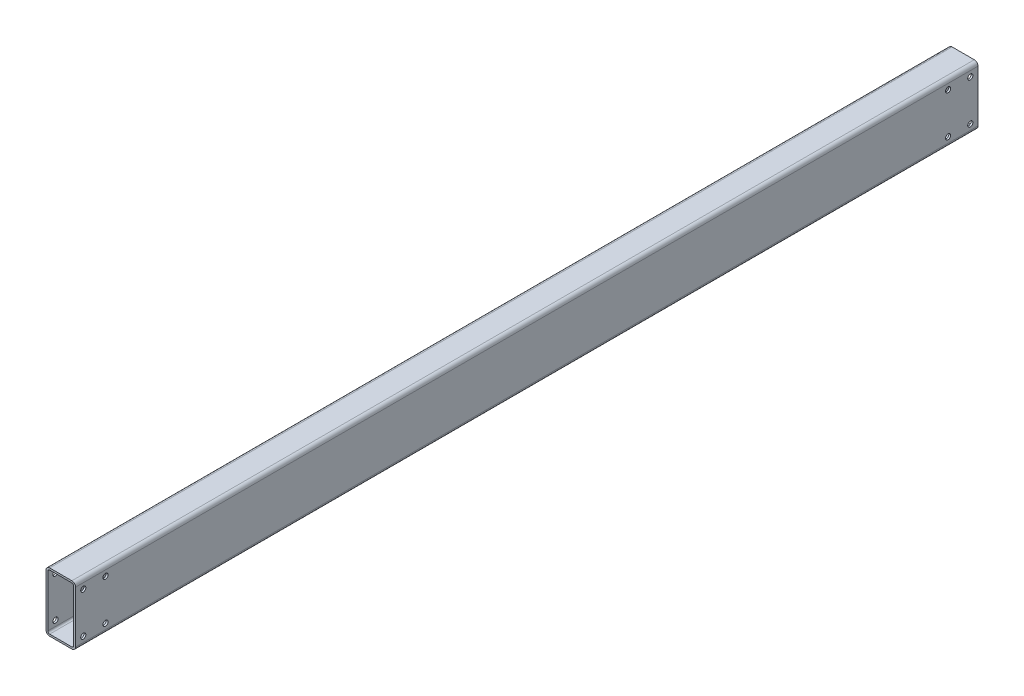
ISO-10303-21;
HEADER;
FILE_DESCRIPTION(('STEP AP214'),'2;1');
FILE_NAME('part.step','',(''),(''),'','','');
FILE_SCHEMA(('AUTOMOTIVE_DESIGN { 1 0 10303 214 1 1 1 1 }'));
ENDSEC;
DATA;
#1=APPLICATION_CONTEXT('core data for automotive mechanical design processes');
#2=APPLICATION_PROTOCOL_DEFINITION('international standard','automotive_design',2000,#1);
#3=PRODUCT_CONTEXT('',#1,'mechanical');
#4=PRODUCT('Part','Part','',(#3));
#5=PRODUCT_RELATED_PRODUCT_CATEGORY('part','',(#4));
#6=PRODUCT_DEFINITION_FORMATION('','',#4);
#7=PRODUCT_DEFINITION_CONTEXT('part definition',#1,'design');
#8=PRODUCT_DEFINITION('design','',#6,#7);
#9=PRODUCT_DEFINITION_SHAPE('','',#8);
#10=(LENGTH_UNIT() NAMED_UNIT(*) SI_UNIT(.MILLI.,.METRE.));
#11=(NAMED_UNIT(*) PLANE_ANGLE_UNIT() SI_UNIT($,.RADIAN.));
#12=(NAMED_UNIT(*) SI_UNIT($,.STERADIAN.) SOLID_ANGLE_UNIT());
#13=UNCERTAINTY_MEASURE_WITH_UNIT(LENGTH_MEASURE(1.E-05),#10,'distance_accuracy_value','');
#14=(GEOMETRIC_REPRESENTATION_CONTEXT(3) GLOBAL_UNCERTAINTY_ASSIGNED_CONTEXT((#13)) GLOBAL_UNIT_ASSIGNED_CONTEXT((#10,
#11,#12)) REPRESENTATION_CONTEXT('',''));
#15=CARTESIAN_POINT('',(0.,0.,0.));
#16=DIRECTION('',(0.,0.,1.));
#17=DIRECTION('',(1.,0.,0.));
#18=AXIS2_PLACEMENT_3D('',#15,#16,#17);
#19=CARTESIAN_POINT('',(15.,-35.,1220.));
#20=DIRECTION('',(0.,0.,1.));
#21=DIRECTION('',(1.,0.,0.));
#22=AXIS2_PLACEMENT_3D('',#19,#20,#21);
#23=PLANE('',#22);
#24=CARTESIAN_POINT('',(15.,-35.,1220.));
#25=DIRECTION('',(0.,0.,1.));
#26=DIRECTION('',(1.,0.,0.));
#27=AXIS2_PLACEMENT_3D('',#24,#25,#26);
#28=CIRCLE('',#27,5.);
#29=CARTESIAN_POINT('',(15.,-40.,1220.));
#30=VERTEX_POINT('',#29);
#31=CARTESIAN_POINT('',(20.,-35.,1220.));
#32=VERTEX_POINT('',#31);
#33=EDGE_CURVE('E221',#30,#32,#28,.T.);
#34=ORIENTED_EDGE('',*,*,#33,.T.);
#35=DIRECTION('',(0.,1.,0.));
#36=VECTOR('',#35,1.);
#37=CARTESIAN_POINT('',(20.,-35.,1220.));
#38=LINE('',#37,#36);
#39=CARTESIAN_POINT('',(20.,35.,1220.));
#40=VERTEX_POINT('',#39);
#41=EDGE_CURVE('E224',#32,#40,#38,.T.);
#42=ORIENTED_EDGE('',*,*,#41,.T.);
#43=CARTESIAN_POINT('',(15.,35.,1220.));
#44=DIRECTION('',(0.,0.,1.));
#45=DIRECTION('',(-1.,0.,0.));
#46=AXIS2_PLACEMENT_3D('',#43,#44,#45);
#47=CIRCLE('',#46,5.);
#48=CARTESIAN_POINT('',(15.,40.,1220.));
#49=VERTEX_POINT('',#48);
#50=EDGE_CURVE('E227',#40,#49,#47,.T.);
#51=ORIENTED_EDGE('',*,*,#50,.T.);
#52=DIRECTION('',(-1.,0.,0.));
#53=VECTOR('',#52,1.);
#54=CARTESIAN_POINT('',(-15.,40.,1220.));
#55=LINE('',#54,#53);
#56=CARTESIAN_POINT('',(-15.,40.,1220.));
#57=VERTEX_POINT('',#56);
#58=EDGE_CURVE('E229',#49,#57,#55,.T.);
#59=ORIENTED_EDGE('',*,*,#58,.T.);
#60=CARTESIAN_POINT('',(-15.,35.,1220.));
#61=DIRECTION('',(0.,0.,1.));
#62=DIRECTION('',(-1.,0.,0.));
#63=AXIS2_PLACEMENT_3D('',#60,#61,#62);
#64=CIRCLE('',#63,5.);
#65=CARTESIAN_POINT('',(-20.,35.,1220.));
#66=VERTEX_POINT('',#65);
#67=EDGE_CURVE('E231',#57,#66,#64,.T.);
#68=ORIENTED_EDGE('',*,*,#67,.T.);
#69=DIRECTION('',(0.,-1.,0.));
#70=VECTOR('',#69,1.);
#71=CARTESIAN_POINT('',(-20.,-35.,1220.));
#72=LINE('',#71,#70);
#73=CARTESIAN_POINT('',(-20.,-35.,1220.));
#74=VERTEX_POINT('',#73);
#75=EDGE_CURVE('E233',#66,#74,#72,.T.);
#76=ORIENTED_EDGE('',*,*,#75,.T.);
#77=CARTESIAN_POINT('',(-15.,-35.,1220.));
#78=DIRECTION('',(0.,0.,1.));
#79=DIRECTION('',(-1.,0.,0.));
#80=AXIS2_PLACEMENT_3D('',#77,#78,#79);
#81=CIRCLE('',#80,5.);
#82=CARTESIAN_POINT('',(-15.,-40.,1220.));
#83=VERTEX_POINT('',#82);
#84=EDGE_CURVE('E235',#74,#83,#81,.T.);
#85=ORIENTED_EDGE('',*,*,#84,.T.);
#86=DIRECTION('',(1.,0.,0.));
#87=VECTOR('',#86,1.);
#88=CARTESIAN_POINT('',(-15.,-40.,1220.));
#89=LINE('',#88,#87);
#90=EDGE_CURVE('E237',#83,#30,#89,.T.);
#91=ORIENTED_EDGE('',*,*,#90,.T.);
#92=EDGE_LOOP('',(#34,#42,#51,#59,#68,#76,#85,#91));
#93=FACE_BOUND('',#92,.T.);
#94=DIRECTION('',(1.,0.,0.));
#95=VECTOR('',#94,1.);
#96=CARTESIAN_POINT('',(-15.,-37.5,1220.));
#97=LINE('',#96,#95);
#98=CARTESIAN_POINT('',(-15.,-37.5,1220.));
#99=VERTEX_POINT('',#98);
#100=CARTESIAN_POINT('',(15.,-37.5,1220.));
#101=VERTEX_POINT('',#100);
#102=EDGE_CURVE('E162',#99,#101,#97,.T.);
#103=ORIENTED_EDGE('',*,*,#102,.F.);
#104=CARTESIAN_POINT('',(-15.,-35.,1220.));
#105=DIRECTION('',(0.,0.,1.));
#106=DIRECTION('',(-1.,0.,0.));
#107=AXIS2_PLACEMENT_3D('',#104,#105,#106);
#108=CIRCLE('',#107,2.5);
#109=CARTESIAN_POINT('',(-17.5,-35.,1220.));
#110=VERTEX_POINT('',#109);
#111=EDGE_CURVE('E154',#110,#99,#108,.T.);
#112=ORIENTED_EDGE('',*,*,#111,.F.);
#113=DIRECTION('',(0.,-1.,0.));
#114=VECTOR('',#113,1.);
#115=CARTESIAN_POINT('',(-17.5,-35.,1220.));
#116=LINE('',#115,#114);
#117=CARTESIAN_POINT('',(-17.5,35.,1220.));
#118=VERTEX_POINT('',#117);
#119=EDGE_CURVE('E188',#118,#110,#116,.T.);
#120=ORIENTED_EDGE('',*,*,#119,.F.);
#121=CARTESIAN_POINT('',(-15.,35.,1220.));
#122=DIRECTION('',(0.,0.,1.));
#123=DIRECTION('',(-1.,0.,0.));
#124=AXIS2_PLACEMENT_3D('',#121,#122,#123);
#125=CIRCLE('',#124,2.5);
#126=CARTESIAN_POINT('',(-15.,37.5,1220.));
#127=VERTEX_POINT('',#126);
#128=EDGE_CURVE('E186',#127,#118,#125,.T.);
#129=ORIENTED_EDGE('',*,*,#128,.F.);
#130=DIRECTION('',(-1.,0.,0.));
#131=VECTOR('',#130,1.);
#132=CARTESIAN_POINT('',(-15.,37.5,1220.));
#133=LINE('',#132,#131);
#134=CARTESIAN_POINT('',(15.,37.5,1220.));
#135=VERTEX_POINT('',#134);
#136=EDGE_CURVE('E184',#135,#127,#133,.T.);
#137=ORIENTED_EDGE('',*,*,#136,.F.);
#138=CARTESIAN_POINT('',(15.,35.,1220.));
#139=DIRECTION('',(0.,0.,1.));
#140=DIRECTION('',(-1.,0.,0.));
#141=AXIS2_PLACEMENT_3D('',#138,#139,#140);
#142=CIRCLE('',#141,2.5);
#143=CARTESIAN_POINT('',(17.5,35.,1220.));
#144=VERTEX_POINT('',#143);
#145=EDGE_CURVE('E182',#144,#135,#142,.T.);
#146=ORIENTED_EDGE('',*,*,#145,.F.);
#147=DIRECTION('',(0.,1.,0.));
#148=VECTOR('',#147,1.);
#149=CARTESIAN_POINT('',(17.5,-35.,1220.));
#150=LINE('',#149,#148);
#151=CARTESIAN_POINT('',(17.5,-35.,1220.));
#152=VERTEX_POINT('',#151);
#153=EDGE_CURVE('E177',#152,#144,#150,.T.);
#154=ORIENTED_EDGE('',*,*,#153,.F.);
#155=CARTESIAN_POINT('',(15.,-35.,1220.));
#156=DIRECTION('',(0.,0.,1.));
#157=DIRECTION('',(1.,0.,0.));
#158=AXIS2_PLACEMENT_3D('',#155,#156,#157);
#159=CIRCLE('',#158,2.5);
#160=EDGE_CURVE('E175',#101,#152,#159,.T.);
#161=ORIENTED_EDGE('',*,*,#160,.F.);
#162=EDGE_LOOP('',(#103,#112,#120,#129,#137,#146,#154,#161));
#163=FACE_BOUND('',#162,.T.);
#164=ADVANCED_FACE('F39',(#93,#163),#23,.T.);
#165=CARTESIAN_POINT('',(15.,-35.,0.));
#166=DIRECTION('',(0.,0.,1.));
#167=DIRECTION('',(1.,0.,0.));
#168=AXIS2_PLACEMENT_3D('',#165,#166,#167);
#169=PLANE('',#168);
#170=CARTESIAN_POINT('',(15.,-35.,0.));
#171=DIRECTION('',(0.,0.,1.));
#172=DIRECTION('',(1.,0.,0.));
#173=AXIS2_PLACEMENT_3D('',#170,#171,#172);
#174=CIRCLE('',#173,5.);
#175=CARTESIAN_POINT('',(15.,-40.,0.));
#176=VERTEX_POINT('',#175);
#177=CARTESIAN_POINT('',(20.,-35.,0.));
#178=VERTEX_POINT('',#177);
#179=EDGE_CURVE('E170',#176,#178,#174,.T.);
#180=ORIENTED_EDGE('',*,*,#179,.F.);
#181=DIRECTION('',(1.,0.,0.));
#182=VECTOR('',#181,1.);
#183=CARTESIAN_POINT('',(-15.,-40.,0.));
#184=LINE('',#183,#182);
#185=CARTESIAN_POINT('',(-15.,-40.,0.));
#186=VERTEX_POINT('',#185);
#187=EDGE_CURVE('E225',#186,#176,#184,.T.);
#188=ORIENTED_EDGE('',*,*,#187,.F.);
#189=CARTESIAN_POINT('',(-15.,-35.,0.));
#190=DIRECTION('',(0.,0.,1.));
#191=DIRECTION('',(-1.,0.,0.));
#192=AXIS2_PLACEMENT_3D('',#189,#190,#191);
#193=CIRCLE('',#192,5.);
#194=CARTESIAN_POINT('',(-20.,-35.,0.));
#195=VERTEX_POINT('',#194);
#196=EDGE_CURVE('E252',#195,#186,#193,.T.);
#197=ORIENTED_EDGE('',*,*,#196,.F.);
#198=DIRECTION('',(0.,-1.,0.));
#199=VECTOR('',#198,1.);
#200=CARTESIAN_POINT('',(-20.,-35.,0.));
#201=LINE('',#200,#199);
#202=CARTESIAN_POINT('',(-20.,35.,0.));
#203=VERTEX_POINT('',#202);
#204=EDGE_CURVE('E250',#203,#195,#201,.T.);
#205=ORIENTED_EDGE('',*,*,#204,.F.);
#206=CARTESIAN_POINT('',(-15.,35.,0.));
#207=DIRECTION('',(0.,0.,1.));
#208=DIRECTION('',(-1.,0.,0.));
#209=AXIS2_PLACEMENT_3D('',#206,#207,#208);
#210=CIRCLE('',#209,5.);
#211=CARTESIAN_POINT('',(-15.,40.,0.));
#212=VERTEX_POINT('',#211);
#213=EDGE_CURVE('E248',#212,#203,#210,.T.);
#214=ORIENTED_EDGE('',*,*,#213,.F.);
#215=DIRECTION('',(-1.,0.,0.));
#216=VECTOR('',#215,1.);
#217=CARTESIAN_POINT('',(-15.,40.,0.));
#218=LINE('',#217,#216);
#219=CARTESIAN_POINT('',(15.,40.,0.));
#220=VERTEX_POINT('',#219);
#221=EDGE_CURVE('E246',#220,#212,#218,.T.);
#222=ORIENTED_EDGE('',*,*,#221,.F.);
#223=CARTESIAN_POINT('',(15.,35.,0.));
#224=DIRECTION('',(0.,0.,1.));
#225=DIRECTION('',(-1.,0.,0.));
#226=AXIS2_PLACEMENT_3D('',#223,#224,#225);
#227=CIRCLE('',#226,5.);
#228=CARTESIAN_POINT('',(20.,35.,0.));
#229=VERTEX_POINT('',#228);
#230=EDGE_CURVE('E244',#229,#220,#227,.T.);
#231=ORIENTED_EDGE('',*,*,#230,.F.);
#232=DIRECTION('',(0.,1.,0.));
#233=VECTOR('',#232,1.);
#234=CARTESIAN_POINT('',(20.,-35.,0.));
#235=LINE('',#234,#233);
#236=EDGE_CURVE('E242',#178,#229,#235,.T.);
#237=ORIENTED_EDGE('',*,*,#236,.F.);
#238=EDGE_LOOP('',(#180,#188,#197,#205,#214,#222,#231,#237));
#239=FACE_BOUND('',#238,.T.);
#240=CARTESIAN_POINT('',(-15.,-35.,0.));
#241=DIRECTION('',(0.,0.,1.));
#242=DIRECTION('',(-1.,0.,0.));
#243=AXIS2_PLACEMENT_3D('',#240,#241,#242);
#244=CIRCLE('',#243,2.5);
#245=CARTESIAN_POINT('',(-17.5,-35.,0.));
#246=VERTEX_POINT('',#245);
#247=CARTESIAN_POINT('',(-15.,-37.5,0.));
#248=VERTEX_POINT('',#247);
#249=EDGE_CURVE('E64',#246,#248,#244,.T.);
#250=ORIENTED_EDGE('',*,*,#249,.T.);
#251=DIRECTION('',(1.,0.,0.));
#252=VECTOR('',#251,1.);
#253=CARTESIAN_POINT('',(-15.,-37.5,0.));
#254=LINE('',#253,#252);
#255=CARTESIAN_POINT('',(15.,-37.5,0.));
#256=VERTEX_POINT('',#255);
#257=EDGE_CURVE('E169',#248,#256,#254,.T.);
#258=ORIENTED_EDGE('',*,*,#257,.T.);
#259=CARTESIAN_POINT('',(15.,-35.,0.));
#260=DIRECTION('',(0.,0.,1.));
#261=DIRECTION('',(1.,0.,0.));
#262=AXIS2_PLACEMENT_3D('',#259,#260,#261);
#263=CIRCLE('',#262,2.5);
#264=CARTESIAN_POINT('',(17.5,-35.,0.));
#265=VERTEX_POINT('',#264);
#266=EDGE_CURVE('E193',#256,#265,#263,.T.);
#267=ORIENTED_EDGE('',*,*,#266,.T.);
#268=DIRECTION('',(0.,1.,0.));
#269=VECTOR('',#268,1.);
#270=CARTESIAN_POINT('',(17.5,-35.,0.));
#271=LINE('',#270,#269);
#272=CARTESIAN_POINT('',(17.5,35.,0.));
#273=VERTEX_POINT('',#272);
#274=EDGE_CURVE('E196',#265,#273,#271,.T.);
#275=ORIENTED_EDGE('',*,*,#274,.T.);
#276=CARTESIAN_POINT('',(15.,35.,0.));
#277=DIRECTION('',(0.,0.,1.));
#278=DIRECTION('',(-1.,0.,0.));
#279=AXIS2_PLACEMENT_3D('',#276,#277,#278);
#280=CIRCLE('',#279,2.5);
#281=CARTESIAN_POINT('',(15.,37.5,0.));
#282=VERTEX_POINT('',#281);
#283=EDGE_CURVE('E199',#273,#282,#280,.T.);
#284=ORIENTED_EDGE('',*,*,#283,.T.);
#285=DIRECTION('',(-1.,0.,0.));
#286=VECTOR('',#285,1.);
#287=CARTESIAN_POINT('',(-15.,37.5,0.));
#288=LINE('',#287,#286);
#289=CARTESIAN_POINT('',(-15.,37.5,0.));
#290=VERTEX_POINT('',#289);
#291=EDGE_CURVE('E202',#282,#290,#288,.T.);
#292=ORIENTED_EDGE('',*,*,#291,.T.);
#293=CARTESIAN_POINT('',(-15.,35.,0.));
#294=DIRECTION('',(0.,0.,1.));
#295=DIRECTION('',(-1.,0.,0.));
#296=AXIS2_PLACEMENT_3D('',#293,#294,#295);
#297=CIRCLE('',#296,2.5);
#298=CARTESIAN_POINT('',(-17.5,35.,0.));
#299=VERTEX_POINT('',#298);
#300=EDGE_CURVE('E205',#290,#299,#297,.T.);
#301=ORIENTED_EDGE('',*,*,#300,.T.);
#302=DIRECTION('',(0.,-1.,0.));
#303=VECTOR('',#302,1.);
#304=CARTESIAN_POINT('',(-17.5,-35.,0.));
#305=LINE('',#304,#303);
#306=EDGE_CURVE('E163',#299,#246,#305,.T.);
#307=ORIENTED_EDGE('',*,*,#306,.T.);
#308=EDGE_LOOP('',(#250,#258,#267,#275,#284,#292,#301,#307));
#309=FACE_BOUND('',#308,.T.);
#310=ADVANCED_FACE('F368',(#239,#309),#169,.F.);
#311=CARTESIAN_POINT('',(15.,-35.,1220.));
#312=DIRECTION('',(0.,0.,-1.));
#313=DIRECTION('',(-1.,0.,0.));
#314=AXIS2_PLACEMENT_3D('',#311,#312,#313);
#315=CYLINDRICAL_SURFACE('',#314,5.);
#316=ORIENTED_EDGE('',*,*,#179,.T.);
#317=DIRECTION('',(0.,0.,-1.));
#318=VECTOR('',#317,1.);
#319=CARTESIAN_POINT('',(20.,-35.,1220.));
#320=LINE('',#319,#318);
#321=EDGE_CURVE('E11',#32,#178,#320,.T.);
#322=ORIENTED_EDGE('',*,*,#321,.F.);
#323=ORIENTED_EDGE('',*,*,#33,.F.);
#324=DIRECTION('',(0.,0.,-1.));
#325=VECTOR('',#324,1.);
#326=CARTESIAN_POINT('',(15.,-40.,1220.));
#327=LINE('',#326,#325);
#328=EDGE_CURVE('E239',#30,#176,#327,.T.);
#329=ORIENTED_EDGE('',*,*,#328,.T.);
#330=EDGE_LOOP('',(#316,#322,#323,#329));
#331=FACE_BOUND('',#330,.T.);
#332=ADVANCED_FACE('F41',(#331),#315,.T.);
#333=CARTESIAN_POINT('',(20.,-35.,1220.));
#334=DIRECTION('',(-1.,0.,0.));
#335=DIRECTION('',(0.,0.,1.));
#336=AXIS2_PLACEMENT_3D('',#333,#334,#335);
#337=PLANE('',#336);
#338=CARTESIAN_POINT('',(20.,-27.5,1209.6));
#339=DIRECTION('',(1.,0.,0.));
#340=DIRECTION('',(0.,0.,-1.));
#341=AXIS2_PLACEMENT_3D('',#338,#339,#340);
#342=CIRCLE('',#341,3.50000000000001);
#343=CARTESIAN_POINT('',(20.,-27.5,1206.1));
#344=VERTEX_POINT('',#343);
#345=EDGE_CURVE('E419',#344,#344,#342,.T.);
#346=ORIENTED_EDGE('',*,*,#345,.F.);
#347=EDGE_LOOP('',(#346));
#348=FACE_BOUND('',#347,.T.);
#349=CARTESIAN_POINT('',(20.,-27.5,1179.6));
#350=DIRECTION('',(1.,0.,0.));
#351=DIRECTION('',(0.,0.,-1.));
#352=AXIS2_PLACEMENT_3D('',#349,#350,#351);
#353=CIRCLE('',#352,3.5);
#354=CARTESIAN_POINT('',(20.,-27.5,1176.1));
#355=VERTEX_POINT('',#354);
#356=EDGE_CURVE('E423',#355,#355,#353,.T.);
#357=ORIENTED_EDGE('',*,*,#356,.F.);
#358=EDGE_LOOP('',(#357));
#359=FACE_BOUND('',#358,.T.);
#360=CARTESIAN_POINT('',(20.,27.5,1179.6));
#361=DIRECTION('',(1.,0.,0.));
#362=DIRECTION('',(0.,0.,-1.));
#363=AXIS2_PLACEMENT_3D('',#360,#361,#362);
#364=CIRCLE('',#363,3.5);
#365=CARTESIAN_POINT('',(20.,27.5,1176.1));
#366=VERTEX_POINT('',#365);
#367=EDGE_CURVE('E427',#366,#366,#364,.T.);
#368=ORIENTED_EDGE('',*,*,#367,.F.);
#369=EDGE_LOOP('',(#368));
#370=FACE_BOUND('',#369,.T.);
#371=CARTESIAN_POINT('',(20.,27.5,1209.6));
#372=DIRECTION('',(1.,0.,0.));
#373=DIRECTION('',(0.,0.,-1.));
#374=AXIS2_PLACEMENT_3D('',#371,#372,#373);
#375=CIRCLE('',#374,3.50000000000001);
#376=CARTESIAN_POINT('',(20.,27.5,1206.1));
#377=VERTEX_POINT('',#376);
#378=EDGE_CURVE('E294',#377,#377,#375,.T.);
#379=ORIENTED_EDGE('',*,*,#378,.F.);
#380=EDGE_LOOP('',(#379));
#381=FACE_BOUND('',#380,.T.);
#382=CARTESIAN_POINT('',(20.,-27.5,10.4));
#383=DIRECTION('',(-1.,0.,0.));
#384=DIRECTION('',(0.,0.,1.));
#385=AXIS2_PLACEMENT_3D('',#382,#383,#384);
#386=CIRCLE('',#385,3.50000000000001);
#387=CARTESIAN_POINT('',(20.,-27.5,13.9));
#388=VERTEX_POINT('',#387);
#389=EDGE_CURVE('E329',#388,#388,#386,.T.);
#390=ORIENTED_EDGE('',*,*,#389,.T.);
#391=EDGE_LOOP('',(#390));
#392=FACE_BOUND('',#391,.T.);
#393=CARTESIAN_POINT('',(20.,-27.5,40.4));
#394=DIRECTION('',(-1.,0.,0.));
#395=DIRECTION('',(0.,0.,1.));
#396=AXIS2_PLACEMENT_3D('',#393,#394,#395);
#397=CIRCLE('',#396,3.5);
#398=CARTESIAN_POINT('',(20.,-27.5,43.9));
#399=VERTEX_POINT('',#398);
#400=EDGE_CURVE('E323',#399,#399,#397,.T.);
#401=ORIENTED_EDGE('',*,*,#400,.T.);
#402=EDGE_LOOP('',(#401));
#403=FACE_BOUND('',#402,.T.);
#404=CARTESIAN_POINT('',(20.,27.5,40.4));
#405=DIRECTION('',(-1.,0.,0.));
#406=DIRECTION('',(0.,0.,1.));
#407=AXIS2_PLACEMENT_3D('',#404,#405,#406);
#408=CIRCLE('',#407,3.5);
#409=CARTESIAN_POINT('',(20.,27.5,43.9));
#410=VERTEX_POINT('',#409);
#411=EDGE_CURVE('E316',#410,#410,#408,.T.);
#412=ORIENTED_EDGE('',*,*,#411,.T.);
#413=EDGE_LOOP('',(#412));
#414=FACE_BOUND('',#413,.T.);
#415=CARTESIAN_POINT('',(20.,27.5,10.4));
#416=DIRECTION('',(-1.,0.,0.));
#417=DIRECTION('',(0.,0.,1.));
#418=AXIS2_PLACEMENT_3D('',#415,#416,#417);
#419=CIRCLE('',#418,3.50000000000001);
#420=CARTESIAN_POINT('',(20.,27.5,13.9));
#421=VERTEX_POINT('',#420);
#422=EDGE_CURVE('E278',#421,#421,#419,.T.);
#423=ORIENTED_EDGE('',*,*,#422,.T.);
#424=EDGE_LOOP('',(#423));
#425=FACE_BOUND('',#424,.T.);
#426=ORIENTED_EDGE('',*,*,#236,.T.);
#427=DIRECTION('',(0.,0.,-1.));
#428=VECTOR('',#427,1.);
#429=CARTESIAN_POINT('',(20.,35.,1220.));
#430=LINE('',#429,#428);
#431=EDGE_CURVE('E48',#40,#229,#430,.T.);
#432=ORIENTED_EDGE('',*,*,#431,.F.);
#433=ORIENTED_EDGE('',*,*,#41,.F.);
#434=ORIENTED_EDGE('',*,*,#321,.T.);
#435=EDGE_LOOP('',(#426,#432,#433,#434));
#436=FACE_BOUND('',#435,.T.);
#437=ADVANCED_FACE('F408',(#348,#359,#370,#381,#392,#403,#414,#425,#436),#337,.F.);
#438=CARTESIAN_POINT('',(15.,35.,1220.));
#439=DIRECTION('',(0.,0.,-1.));
#440=DIRECTION('',(-1.,0.,0.));
#441=AXIS2_PLACEMENT_3D('',#438,#439,#440);
#442=CYLINDRICAL_SURFACE('',#441,5.);
#443=ORIENTED_EDGE('',*,*,#230,.T.);
#444=DIRECTION('',(0.,0.,-1.));
#445=VECTOR('',#444,1.);
#446=CARTESIAN_POINT('',(15.,40.,1220.));
#447=LINE('',#446,#445);
#448=EDGE_CURVE('E269',#49,#220,#447,.T.);
#449=ORIENTED_EDGE('',*,*,#448,.F.);
#450=ORIENTED_EDGE('',*,*,#50,.F.);
#451=ORIENTED_EDGE('',*,*,#431,.T.);
#452=EDGE_LOOP('',(#443,#449,#450,#451));
#453=FACE_BOUND('',#452,.T.);
#454=ADVANCED_FACE('F405',(#453),#442,.T.);
#455=CARTESIAN_POINT('',(-15.,40.,1220.));
#456=DIRECTION('',(0.,-1.,0.));
#457=DIRECTION('',(0.,0.,-1.));
#458=AXIS2_PLACEMENT_3D('',#455,#456,#457);
#459=PLANE('',#458);
#460=ORIENTED_EDGE('',*,*,#221,.T.);
#461=DIRECTION('',(0.,0.,-1.));
#462=VECTOR('',#461,1.);
#463=CARTESIAN_POINT('',(-15.,40.,1220.));
#464=LINE('',#463,#462);
#465=EDGE_CURVE('E266',#57,#212,#464,.T.);
#466=ORIENTED_EDGE('',*,*,#465,.F.);
#467=ORIENTED_EDGE('',*,*,#58,.F.);
#468=ORIENTED_EDGE('',*,*,#448,.T.);
#469=EDGE_LOOP('',(#460,#466,#467,#468));
#470=FACE_BOUND('',#469,.T.);
#471=ADVANCED_FACE('F401',(#470),#459,.F.);
#472=CARTESIAN_POINT('',(-15.,35.,1220.));
#473=DIRECTION('',(0.,0.,-1.));
#474=DIRECTION('',(-1.,0.,0.));
#475=AXIS2_PLACEMENT_3D('',#472,#473,#474);
#476=CYLINDRICAL_SURFACE('',#475,5.);
#477=ORIENTED_EDGE('',*,*,#213,.T.);
#478=DIRECTION('',(0.,0.,-1.));
#479=VECTOR('',#478,1.);
#480=CARTESIAN_POINT('',(-20.,35.,1220.));
#481=LINE('',#480,#479);
#482=EDGE_CURVE('E263',#66,#203,#481,.T.);
#483=ORIENTED_EDGE('',*,*,#482,.F.);
#484=ORIENTED_EDGE('',*,*,#67,.F.);
#485=ORIENTED_EDGE('',*,*,#465,.T.);
#486=EDGE_LOOP('',(#477,#483,#484,#485));
#487=FACE_BOUND('',#486,.T.);
#488=ADVANCED_FACE('F397',(#487),#476,.T.);
#489=CARTESIAN_POINT('',(-20.,-35.,1220.));
#490=DIRECTION('',(1.,0.,0.));
#491=DIRECTION('',(0.,0.,-1.));
#492=AXIS2_PLACEMENT_3D('',#489,#490,#491);
#493=PLANE('',#492);
#494=CARTESIAN_POINT('',(-20.,-27.5,1209.6));
#495=DIRECTION('',(1.,0.,0.));
#496=DIRECTION('',(0.,0.,-1.));
#497=AXIS2_PLACEMENT_3D('',#494,#495,#496);
#498=CIRCLE('',#497,3.50000000000001);
#499=CARTESIAN_POINT('',(-20.,-27.5,1206.1));
#500=VERTEX_POINT('',#499);
#501=EDGE_CURVE('E756',#500,#500,#498,.T.);
#502=ORIENTED_EDGE('',*,*,#501,.T.);
#503=EDGE_LOOP('',(#502));
#504=FACE_BOUND('',#503,.T.);
#505=CARTESIAN_POINT('',(-20.,-27.5,1179.6));
#506=DIRECTION('',(1.,0.,0.));
#507=DIRECTION('',(0.,0.,-1.));
#508=AXIS2_PLACEMENT_3D('',#505,#506,#507);
#509=CIRCLE('',#508,3.5);
#510=CARTESIAN_POINT('',(-20.,-27.5,1176.1));
#511=VERTEX_POINT('',#510);
#512=EDGE_CURVE('E755',#511,#511,#509,.T.);
#513=ORIENTED_EDGE('',*,*,#512,.T.);
#514=EDGE_LOOP('',(#513));
#515=FACE_BOUND('',#514,.T.);
#516=CARTESIAN_POINT('',(-20.,27.5,1179.6));
#517=DIRECTION('',(1.,0.,0.));
#518=DIRECTION('',(0.,0.,-1.));
#519=AXIS2_PLACEMENT_3D('',#516,#517,#518);
#520=CIRCLE('',#519,3.5);
#521=CARTESIAN_POINT('',(-20.,27.5,1176.1));
#522=VERTEX_POINT('',#521);
#523=EDGE_CURVE('E768',#522,#522,#520,.T.);
#524=ORIENTED_EDGE('',*,*,#523,.T.);
#525=EDGE_LOOP('',(#524));
#526=FACE_BOUND('',#525,.T.);
#527=CARTESIAN_POINT('',(-20.,27.5,1209.6));
#528=DIRECTION('',(1.,0.,0.));
#529=DIRECTION('',(0.,0.,-1.));
#530=AXIS2_PLACEMENT_3D('',#527,#528,#529);
#531=CIRCLE('',#530,3.50000000000001);
#532=CARTESIAN_POINT('',(-20.,27.5,1206.1));
#533=VERTEX_POINT('',#532);
#534=EDGE_CURVE('E764',#533,#533,#531,.T.);
#535=ORIENTED_EDGE('',*,*,#534,.T.);
#536=EDGE_LOOP('',(#535));
#537=FACE_BOUND('',#536,.T.);
#538=CARTESIAN_POINT('',(-20.,-27.5,10.4));
#539=DIRECTION('',(-1.,0.,0.));
#540=DIRECTION('',(0.,0.,1.));
#541=AXIS2_PLACEMENT_3D('',#538,#539,#540);
#542=CIRCLE('',#541,3.50000000000001);
#543=CARTESIAN_POINT('',(-20.,-27.5,13.9));
#544=VERTEX_POINT('',#543);
#545=EDGE_CURVE('E315',#544,#544,#542,.T.);
#546=ORIENTED_EDGE('',*,*,#545,.F.);
#547=EDGE_LOOP('',(#546));
#548=FACE_BOUND('',#547,.T.);
#549=CARTESIAN_POINT('',(-20.,-27.5,40.4));
#550=DIRECTION('',(-1.,0.,0.));
#551=DIRECTION('',(0.,0.,1.));
#552=AXIS2_PLACEMENT_3D('',#549,#550,#551);
#553=CIRCLE('',#552,3.5);
#554=CARTESIAN_POINT('',(-20.,-27.5,43.9));
#555=VERTEX_POINT('',#554);
#556=EDGE_CURVE('E326',#555,#555,#553,.T.);
#557=ORIENTED_EDGE('',*,*,#556,.F.);
#558=EDGE_LOOP('',(#557));
#559=FACE_BOUND('',#558,.T.);
#560=CARTESIAN_POINT('',(-20.,27.5,40.4));
#561=DIRECTION('',(-1.,0.,0.));
#562=DIRECTION('',(0.,0.,1.));
#563=AXIS2_PLACEMENT_3D('',#560,#561,#562);
#564=CIRCLE('',#563,3.5);
#565=CARTESIAN_POINT('',(-20.,27.5,43.9));
#566=VERTEX_POINT('',#565);
#567=EDGE_CURVE('E320',#566,#566,#564,.T.);
#568=ORIENTED_EDGE('',*,*,#567,.F.);
#569=EDGE_LOOP('',(#568));
#570=FACE_BOUND('',#569,.T.);
#571=CARTESIAN_POINT('',(-20.,27.5,10.4));
#572=DIRECTION('',(-1.,0.,0.));
#573=DIRECTION('',(0.,0.,1.));
#574=AXIS2_PLACEMENT_3D('',#571,#572,#573);
#575=CIRCLE('',#574,3.50000000000001);
#576=CARTESIAN_POINT('',(-20.,27.5,13.9));
#577=VERTEX_POINT('',#576);
#578=EDGE_CURVE('E319',#577,#577,#575,.T.);
#579=ORIENTED_EDGE('',*,*,#578,.F.);
#580=EDGE_LOOP('',(#579));
#581=FACE_BOUND('',#580,.T.);
#582=ORIENTED_EDGE('',*,*,#204,.T.);
#583=DIRECTION('',(0.,0.,-1.));
#584=VECTOR('',#583,1.);
#585=CARTESIAN_POINT('',(-20.,-35.,1220.));
#586=LINE('',#585,#584);
#587=EDGE_CURVE('E260',#74,#195,#586,.T.);
#588=ORIENTED_EDGE('',*,*,#587,.F.);
#589=ORIENTED_EDGE('',*,*,#75,.F.);
#590=ORIENTED_EDGE('',*,*,#482,.T.);
#591=EDGE_LOOP('',(#582,#588,#589,#590));
#592=FACE_BOUND('',#591,.T.);
#593=ADVANCED_FACE('F393',(#504,#515,#526,#537,#548,#559,#570,#581,#592),#493,.F.);
#594=CARTESIAN_POINT('',(-15.,-35.,1220.));
#595=DIRECTION('',(0.,0.,-1.));
#596=DIRECTION('',(-1.,0.,0.));
#597=AXIS2_PLACEMENT_3D('',#594,#595,#596);
#598=CYLINDRICAL_SURFACE('',#597,5.);
#599=ORIENTED_EDGE('',*,*,#196,.T.);
#600=DIRECTION('',(0.,0.,-1.));
#601=VECTOR('',#600,1.);
#602=CARTESIAN_POINT('',(-15.,-40.,1220.));
#603=LINE('',#602,#601);
#604=EDGE_CURVE('E257',#83,#186,#603,.T.);
#605=ORIENTED_EDGE('',*,*,#604,.F.);
#606=ORIENTED_EDGE('',*,*,#84,.F.);
#607=ORIENTED_EDGE('',*,*,#587,.T.);
#608=EDGE_LOOP('',(#599,#605,#606,#607));
#609=FACE_BOUND('',#608,.T.);
#610=ADVANCED_FACE('F389',(#609),#598,.T.);
#611=CARTESIAN_POINT('',(-15.,-40.,1220.));
#612=DIRECTION('',(0.,1.,0.));
#613=DIRECTION('',(0.,0.,1.));
#614=AXIS2_PLACEMENT_3D('',#611,#612,#613);
#615=PLANE('',#614);
#616=ORIENTED_EDGE('',*,*,#187,.T.);
#617=ORIENTED_EDGE('',*,*,#328,.F.);
#618=ORIENTED_EDGE('',*,*,#90,.F.);
#619=ORIENTED_EDGE('',*,*,#604,.T.);
#620=EDGE_LOOP('',(#616,#617,#618,#619));
#621=FACE_BOUND('',#620,.T.);
#622=ADVANCED_FACE('F386',(#621),#615,.F.);
#623=CARTESIAN_POINT('',(-15.,-35.,1220.));
#624=DIRECTION('',(0.,0.,-1.));
#625=DIRECTION('',(-1.,0.,0.));
#626=AXIS2_PLACEMENT_3D('',#623,#624,#625);
#627=CYLINDRICAL_SURFACE('',#626,2.5);
#628=ORIENTED_EDGE('',*,*,#249,.F.);
#629=DIRECTION('',(0.,0.,-1.));
#630=VECTOR('',#629,1.);
#631=CARTESIAN_POINT('',(-17.5,-35.,1220.));
#632=LINE('',#631,#630);
#633=EDGE_CURVE('E158',#110,#246,#632,.T.);
#634=ORIENTED_EDGE('',*,*,#633,.F.);
#635=ORIENTED_EDGE('',*,*,#111,.T.);
#636=DIRECTION('',(0.,0.,-1.));
#637=VECTOR('',#636,1.);
#638=CARTESIAN_POINT('',(-15.,-37.5,1220.));
#639=LINE('',#638,#637);
#640=EDGE_CURVE('E157',#99,#248,#639,.T.);
#641=ORIENTED_EDGE('',*,*,#640,.T.);
#642=EDGE_LOOP('',(#628,#634,#635,#641));
#643=FACE_BOUND('',#642,.T.);
#644=ADVANCED_FACE('F156',(#643),#627,.F.);
#645=CARTESIAN_POINT('',(-15.,-37.5,1220.));
#646=DIRECTION('',(0.,1.,0.));
#647=DIRECTION('',(0.,0.,1.));
#648=AXIS2_PLACEMENT_3D('',#645,#646,#647);
#649=PLANE('',#648);
#650=ORIENTED_EDGE('',*,*,#257,.F.);
#651=ORIENTED_EDGE('',*,*,#640,.F.);
#652=ORIENTED_EDGE('',*,*,#102,.T.);
#653=DIRECTION('',(0.,0.,-1.));
#654=VECTOR('',#653,1.);
#655=CARTESIAN_POINT('',(15.,-37.5,1220.));
#656=LINE('',#655,#654);
#657=EDGE_CURVE('E171',#101,#256,#656,.T.);
#658=ORIENTED_EDGE('',*,*,#657,.T.);
#659=EDGE_LOOP('',(#650,#651,#652,#658));
#660=FACE_BOUND('',#659,.T.);
#661=ADVANCED_FACE('F166',(#660),#649,.T.);
#662=CARTESIAN_POINT('',(15.,-35.,1220.));
#663=DIRECTION('',(0.,0.,-1.));
#664=DIRECTION('',(-1.,0.,0.));
#665=AXIS2_PLACEMENT_3D('',#662,#663,#664);
#666=CYLINDRICAL_SURFACE('',#665,2.5);
#667=ORIENTED_EDGE('',*,*,#266,.F.);
#668=ORIENTED_EDGE('',*,*,#657,.F.);
#669=ORIENTED_EDGE('',*,*,#160,.T.);
#670=DIRECTION('',(0.,0.,-1.));
#671=VECTOR('',#670,1.);
#672=CARTESIAN_POINT('',(17.5,-35.,1220.));
#673=LINE('',#672,#671);
#674=EDGE_CURVE('E218',#152,#265,#673,.T.);
#675=ORIENTED_EDGE('',*,*,#674,.T.);
#676=EDGE_LOOP('',(#667,#668,#669,#675));
#677=FACE_BOUND('',#676,.T.);
#678=ADVANCED_FACE('F353',(#677),#666,.F.);
#679=CARTESIAN_POINT('',(17.5,-35.,1220.));
#680=DIRECTION('',(-1.,0.,0.));
#681=DIRECTION('',(0.,-1.,0.));
#682=AXIS2_PLACEMENT_3D('',#679,#680,#681);
#683=PLANE('',#682);
#684=CARTESIAN_POINT('',(17.5,-27.5,1209.6));
#685=DIRECTION('',(-1.,0.,0.));
#686=DIRECTION('',(0.,-1.,0.));
#687=AXIS2_PLACEMENT_3D('',#684,#685,#686);
#688=CIRCLE('',#687,3.50000000000001);
#689=CARTESIAN_POINT('',(17.5,-31.,1209.6));
#690=VERTEX_POINT('',#689);
#691=EDGE_CURVE('E312',#690,#690,#688,.F.);
#692=ORIENTED_EDGE('',*,*,#691,.T.);
#693=EDGE_LOOP('',(#692));
#694=FACE_BOUND('',#693,.T.);
#695=CARTESIAN_POINT('',(17.5,-27.5,1179.6));
#696=DIRECTION('',(-1.,0.,0.));
#697=DIRECTION('',(0.,-1.,0.));
#698=AXIS2_PLACEMENT_3D('',#695,#696,#697);
#699=CIRCLE('',#698,3.5);
#700=CARTESIAN_POINT('',(17.5,-31.,1179.6));
#701=VERTEX_POINT('',#700);
#702=EDGE_CURVE('E300',#701,#701,#699,.F.);
#703=ORIENTED_EDGE('',*,*,#702,.T.);
#704=EDGE_LOOP('',(#703));
#705=FACE_BOUND('',#704,.T.);
#706=CARTESIAN_POINT('',(17.5,27.5,1179.6));
#707=DIRECTION('',(-1.,0.,0.));
#708=DIRECTION('',(0.,-1.,0.));
#709=AXIS2_PLACEMENT_3D('',#706,#707,#708);
#710=CIRCLE('',#709,3.5);
#711=CARTESIAN_POINT('',(17.5,24.,1179.6));
#712=VERTEX_POINT('',#711);
#713=EDGE_CURVE('E297',#712,#712,#710,.F.);
#714=ORIENTED_EDGE('',*,*,#713,.T.);
#715=EDGE_LOOP('',(#714));
#716=FACE_BOUND('',#715,.T.);
#717=CARTESIAN_POINT('',(17.5,27.5,1209.6));
#718=DIRECTION('',(-1.,0.,0.));
#719=DIRECTION('',(0.,-1.,0.));
#720=AXIS2_PLACEMENT_3D('',#717,#718,#719);
#721=CIRCLE('',#720,3.50000000000001);
#722=CARTESIAN_POINT('',(17.5,24.,1209.6));
#723=VERTEX_POINT('',#722);
#724=EDGE_CURVE('E293',#723,#723,#721,.F.);
#725=ORIENTED_EDGE('',*,*,#724,.T.);
#726=EDGE_LOOP('',(#725));
#727=FACE_BOUND('',#726,.T.);
#728=CARTESIAN_POINT('',(17.5,-27.5,10.4));
#729=DIRECTION('',(-1.,0.,0.));
#730=DIRECTION('',(0.,-1.,0.));
#731=AXIS2_PLACEMENT_3D('',#728,#729,#730);
#732=CIRCLE('',#731,3.50000000000001);
#733=CARTESIAN_POINT('',(17.5,-31.,10.4));
#734=VERTEX_POINT('',#733);
#735=EDGE_CURVE('E191',#734,#734,#732,.T.);
#736=ORIENTED_EDGE('',*,*,#735,.F.);
#737=EDGE_LOOP('',(#736));
#738=FACE_BOUND('',#737,.T.);
#739=CARTESIAN_POINT('',(17.5,-27.5,40.4));
#740=DIRECTION('',(-1.,0.,0.));
#741=DIRECTION('',(0.,-1.,0.));
#742=AXIS2_PLACEMENT_3D('',#739,#740,#741);
#743=CIRCLE('',#742,3.5);
#744=CARTESIAN_POINT('',(17.5,-31.,40.4));
#745=VERTEX_POINT('',#744);
#746=EDGE_CURVE('E286',#745,#745,#743,.T.);
#747=ORIENTED_EDGE('',*,*,#746,.F.);
#748=EDGE_LOOP('',(#747));
#749=FACE_BOUND('',#748,.T.);
#750=CARTESIAN_POINT('',(17.5,27.5,40.4));
#751=DIRECTION('',(-1.,0.,0.));
#752=DIRECTION('',(0.,-1.,0.));
#753=AXIS2_PLACEMENT_3D('',#750,#751,#752);
#754=CIRCLE('',#753,3.5);
#755=CARTESIAN_POINT('',(17.5,24.,40.4));
#756=VERTEX_POINT('',#755);
#757=EDGE_CURVE('E282',#756,#756,#754,.T.);
#758=ORIENTED_EDGE('',*,*,#757,.F.);
#759=EDGE_LOOP('',(#758));
#760=FACE_BOUND('',#759,.T.);
#761=CARTESIAN_POINT('',(17.5,27.5,10.4));
#762=DIRECTION('',(-1.,0.,0.));
#763=DIRECTION('',(0.,-1.,0.));
#764=AXIS2_PLACEMENT_3D('',#761,#762,#763);
#765=CIRCLE('',#764,3.50000000000001);
#766=CARTESIAN_POINT('',(17.5,24.,10.4));
#767=VERTEX_POINT('',#766);
#768=EDGE_CURVE('E277',#767,#767,#765,.T.);
#769=ORIENTED_EDGE('',*,*,#768,.F.);
#770=EDGE_LOOP('',(#769));
#771=FACE_BOUND('',#770,.T.);
#772=ORIENTED_EDGE('',*,*,#274,.F.);
#773=ORIENTED_EDGE('',*,*,#674,.F.);
#774=ORIENTED_EDGE('',*,*,#153,.T.);
#775=DIRECTION('',(0.,0.,-1.));
#776=VECTOR('',#775,1.);
#777=CARTESIAN_POINT('',(17.5,35.,1220.));
#778=LINE('',#777,#776);
#779=EDGE_CURVE('E216',#144,#273,#778,.T.);
#780=ORIENTED_EDGE('',*,*,#779,.T.);
#781=EDGE_LOOP('',(#772,#773,#774,#780));
#782=FACE_BOUND('',#781,.T.);
#783=ADVANCED_FACE('F349',(#694,#705,#716,#727,#738,#749,#760,#771,#782),#683,.T.);
#784=CARTESIAN_POINT('',(15.,35.,1220.));
#785=DIRECTION('',(0.,0.,-1.));
#786=DIRECTION('',(-1.,0.,0.));
#787=AXIS2_PLACEMENT_3D('',#784,#785,#786);
#788=CYLINDRICAL_SURFACE('',#787,2.5);
#789=ORIENTED_EDGE('',*,*,#283,.F.);
#790=ORIENTED_EDGE('',*,*,#779,.F.);
#791=ORIENTED_EDGE('',*,*,#145,.T.);
#792=DIRECTION('',(0.,0.,-1.));
#793=VECTOR('',#792,1.);
#794=CARTESIAN_POINT('',(15.,37.5,1220.));
#795=LINE('',#794,#793);
#796=EDGE_CURVE('E214',#135,#282,#795,.T.);
#797=ORIENTED_EDGE('',*,*,#796,.T.);
#798=EDGE_LOOP('',(#789,#790,#791,#797));
#799=FACE_BOUND('',#798,.T.);
#800=ADVANCED_FACE('F352',(#799),#788,.F.);
#801=CARTESIAN_POINT('',(-15.,37.5,1220.));
#802=DIRECTION('',(0.,-1.,0.));
#803=DIRECTION('',(0.,0.,-1.));
#804=AXIS2_PLACEMENT_3D('',#801,#802,#803);
#805=PLANE('',#804);
#806=ORIENTED_EDGE('',*,*,#291,.F.);
#807=ORIENTED_EDGE('',*,*,#796,.F.);
#808=ORIENTED_EDGE('',*,*,#136,.T.);
#809=DIRECTION('',(0.,0.,-1.));
#810=VECTOR('',#809,1.);
#811=CARTESIAN_POINT('',(-15.,37.5,1220.));
#812=LINE('',#811,#810);
#813=EDGE_CURVE('E212',#127,#290,#812,.T.);
#814=ORIENTED_EDGE('',*,*,#813,.T.);
#815=EDGE_LOOP('',(#806,#807,#808,#814));
#816=FACE_BOUND('',#815,.T.);
#817=ADVANCED_FACE('F506',(#816),#805,.T.);
#818=CARTESIAN_POINT('',(-15.,35.,1220.));
#819=DIRECTION('',(0.,0.,-1.));
#820=DIRECTION('',(-1.,0.,0.));
#821=AXIS2_PLACEMENT_3D('',#818,#819,#820);
#822=CYLINDRICAL_SURFACE('',#821,2.5);
#823=ORIENTED_EDGE('',*,*,#300,.F.);
#824=ORIENTED_EDGE('',*,*,#813,.F.);
#825=ORIENTED_EDGE('',*,*,#128,.T.);
#826=DIRECTION('',(0.,0.,-1.));
#827=VECTOR('',#826,1.);
#828=CARTESIAN_POINT('',(-17.5,35.,1220.));
#829=LINE('',#828,#827);
#830=EDGE_CURVE('E56',#118,#299,#829,.T.);
#831=ORIENTED_EDGE('',*,*,#830,.T.);
#832=EDGE_LOOP('',(#823,#824,#825,#831));
#833=FACE_BOUND('',#832,.T.);
#834=ADVANCED_FACE('F490',(#833),#822,.F.);
#835=CARTESIAN_POINT('',(-17.5,-35.,1220.));
#836=DIRECTION('',(1.,0.,0.));
#837=DIRECTION('',(0.,0.,-1.));
#838=AXIS2_PLACEMENT_3D('',#835,#836,#837);
#839=PLANE('',#838);
#840=CARTESIAN_POINT('',(-17.5,-27.5,1209.6));
#841=DIRECTION('',(1.,0.,0.));
#842=DIRECTION('',(0.,0.,-1.));
#843=AXIS2_PLACEMENT_3D('',#840,#841,#842);
#844=CIRCLE('',#843,3.50000000000001);
#845=CARTESIAN_POINT('',(-17.5,-27.5,1206.1));
#846=VERTEX_POINT('',#845);
#847=EDGE_CURVE('E43',#846,#846,#844,.F.);
#848=ORIENTED_EDGE('',*,*,#847,.T.);
#849=EDGE_LOOP('',(#848));
#850=FACE_BOUND('',#849,.T.);
#851=CARTESIAN_POINT('',(-17.5,-27.5,1179.6));
#852=DIRECTION('',(1.,0.,0.));
#853=DIRECTION('',(0.,0.,-1.));
#854=AXIS2_PLACEMENT_3D('',#851,#852,#853);
#855=CIRCLE('',#854,3.5);
#856=CARTESIAN_POINT('',(-17.5,-27.5,1176.1));
#857=VERTEX_POINT('',#856);
#858=EDGE_CURVE('E298',#857,#857,#855,.F.);
#859=ORIENTED_EDGE('',*,*,#858,.T.);
#860=EDGE_LOOP('',(#859));
#861=FACE_BOUND('',#860,.T.);
#862=CARTESIAN_POINT('',(-17.5,27.5,1179.6));
#863=DIRECTION('',(1.,0.,0.));
#864=DIRECTION('',(0.,0.,-1.));
#865=AXIS2_PLACEMENT_3D('',#862,#863,#864);
#866=CIRCLE('',#865,3.5);
#867=CARTESIAN_POINT('',(-17.5,27.5,1176.1));
#868=VERTEX_POINT('',#867);
#869=EDGE_CURVE('E295',#868,#868,#866,.F.);
#870=ORIENTED_EDGE('',*,*,#869,.T.);
#871=EDGE_LOOP('',(#870));
#872=FACE_BOUND('',#871,.T.);
#873=CARTESIAN_POINT('',(-17.5,27.5,1209.6));
#874=DIRECTION('',(1.,0.,0.));
#875=DIRECTION('',(0.,0.,-1.));
#876=AXIS2_PLACEMENT_3D('',#873,#874,#875);
#877=CIRCLE('',#876,3.50000000000001);
#878=CARTESIAN_POINT('',(-17.5,27.5,1206.1));
#879=VERTEX_POINT('',#878);
#880=EDGE_CURVE('E290',#879,#879,#877,.F.);
#881=ORIENTED_EDGE('',*,*,#880,.T.);
#882=EDGE_LOOP('',(#881));
#883=FACE_BOUND('',#882,.T.);
#884=CARTESIAN_POINT('',(-17.5,-27.5,10.4));
#885=DIRECTION('',(1.,0.,0.));
#886=DIRECTION('',(0.,0.,-1.));
#887=AXIS2_PLACEMENT_3D('',#884,#885,#886);
#888=CIRCLE('',#887,3.50000000000001);
#889=CARTESIAN_POINT('',(-17.5,-27.5,6.89999999999999));
#890=VERTEX_POINT('',#889);
#891=EDGE_CURVE('E287',#890,#890,#888,.T.);
#892=ORIENTED_EDGE('',*,*,#891,.F.);
#893=EDGE_LOOP('',(#892));
#894=FACE_BOUND('',#893,.T.);
#895=CARTESIAN_POINT('',(-17.5,-27.5,40.4));
#896=DIRECTION('',(1.,0.,0.));
#897=DIRECTION('',(0.,0.,-1.));
#898=AXIS2_PLACEMENT_3D('',#895,#896,#897);
#899=CIRCLE('',#898,3.5);
#900=CARTESIAN_POINT('',(-17.5,-27.5,36.9));
#901=VERTEX_POINT('',#900);
#902=EDGE_CURVE('E283',#901,#901,#899,.T.);
#903=ORIENTED_EDGE('',*,*,#902,.F.);
#904=EDGE_LOOP('',(#903));
#905=FACE_BOUND('',#904,.T.);
#906=CARTESIAN_POINT('',(-17.5,27.5,40.4));
#907=DIRECTION('',(1.,0.,0.));
#908=DIRECTION('',(0.,0.,-1.));
#909=AXIS2_PLACEMENT_3D('',#906,#907,#908);
#910=CIRCLE('',#909,3.5);
#911=CARTESIAN_POINT('',(-17.5,27.5,36.9));
#912=VERTEX_POINT('',#911);
#913=EDGE_CURVE('E279',#912,#912,#910,.T.);
#914=ORIENTED_EDGE('',*,*,#913,.F.);
#915=EDGE_LOOP('',(#914));
#916=FACE_BOUND('',#915,.T.);
#917=CARTESIAN_POINT('',(-17.5,27.5,10.4));
#918=DIRECTION('',(1.,0.,0.));
#919=DIRECTION('',(0.,0.,-1.));
#920=AXIS2_PLACEMENT_3D('',#917,#918,#919);
#921=CIRCLE('',#920,3.50000000000001);
#922=CARTESIAN_POINT('',(-17.5,27.5,6.89999999999999));
#923=VERTEX_POINT('',#922);
#924=EDGE_CURVE('E274',#923,#923,#921,.T.);
#925=ORIENTED_EDGE('',*,*,#924,.F.);
#926=EDGE_LOOP('',(#925));
#927=FACE_BOUND('',#926,.T.);
#928=ORIENTED_EDGE('',*,*,#306,.F.);
#929=ORIENTED_EDGE('',*,*,#830,.F.);
#930=ORIENTED_EDGE('',*,*,#119,.T.);
#931=ORIENTED_EDGE('',*,*,#633,.T.);
#932=EDGE_LOOP('',(#928,#929,#930,#931));
#933=FACE_BOUND('',#932,.T.);
#934=ADVANCED_FACE('F483',(#850,#861,#872,#883,#894,#905,#916,#927,#933),#839,.T.);
#935=CARTESIAN_POINT('',(20.,27.5,10.4));
#936=DIRECTION('',(-1.,0.,0.));
#937=DIRECTION('',(0.,0.,1.));
#938=AXIS2_PLACEMENT_3D('',#935,#936,#937);
#939=CYLINDRICAL_SURFACE('',#938,3.50000000000001);
#940=ORIENTED_EDGE('',*,*,#924,.T.);
#941=EDGE_LOOP('',(#940));
#942=FACE_BOUND('',#941,.T.);
#943=ORIENTED_EDGE('',*,*,#578,.T.);
#944=EDGE_LOOP('',(#943));
#945=FACE_BOUND('',#944,.T.);
#946=ADVANCED_FACE('F469',(#942,#945),#939,.F.);
#947=CARTESIAN_POINT('',(20.,27.5,40.4));
#948=DIRECTION('',(-1.,0.,0.));
#949=DIRECTION('',(0.,0.,1.));
#950=AXIS2_PLACEMENT_3D('',#947,#948,#949);
#951=CYLINDRICAL_SURFACE('',#950,3.5);
#952=ORIENTED_EDGE('',*,*,#913,.T.);
#953=EDGE_LOOP('',(#952));
#954=FACE_BOUND('',#953,.T.);
#955=ORIENTED_EDGE('',*,*,#567,.T.);
#956=EDGE_LOOP('',(#955));
#957=FACE_BOUND('',#956,.T.);
#958=ADVANCED_FACE('F477',(#954,#957),#951,.F.);
#959=CARTESIAN_POINT('',(20.,-27.5,40.4));
#960=DIRECTION('',(-1.,0.,0.));
#961=DIRECTION('',(0.,0.,1.));
#962=AXIS2_PLACEMENT_3D('',#959,#960,#961);
#963=CYLINDRICAL_SURFACE('',#962,3.5);
#964=ORIENTED_EDGE('',*,*,#902,.T.);
#965=EDGE_LOOP('',(#964));
#966=FACE_BOUND('',#965,.T.);
#967=ORIENTED_EDGE('',*,*,#556,.T.);
#968=EDGE_LOOP('',(#967));
#969=FACE_BOUND('',#968,.T.);
#970=ADVANCED_FACE('F478',(#966,#969),#963,.F.);
#971=CARTESIAN_POINT('',(20.,-27.5,10.4));
#972=DIRECTION('',(-1.,0.,0.));
#973=DIRECTION('',(0.,0.,1.));
#974=AXIS2_PLACEMENT_3D('',#971,#972,#973);
#975=CYLINDRICAL_SURFACE('',#974,3.50000000000001);
#976=ORIENTED_EDGE('',*,*,#891,.T.);
#977=EDGE_LOOP('',(#976));
#978=FACE_BOUND('',#977,.T.);
#979=ORIENTED_EDGE('',*,*,#545,.T.);
#980=EDGE_LOOP('',(#979));
#981=FACE_BOUND('',#980,.T.);
#982=ADVANCED_FACE('F466',(#978,#981),#975,.F.);
#983=ORIENTED_EDGE('',*,*,#768,.T.);
#984=EDGE_LOOP('',(#983));
#985=FACE_BOUND('',#984,.T.);
#986=ORIENTED_EDGE('',*,*,#422,.F.);
#987=EDGE_LOOP('',(#986));
#988=FACE_BOUND('',#987,.T.);
#989=ADVANCED_FACE('F463',(#985,#988),#939,.F.);
#990=ORIENTED_EDGE('',*,*,#757,.T.);
#991=EDGE_LOOP('',(#990));
#992=FACE_BOUND('',#991,.T.);
#993=ORIENTED_EDGE('',*,*,#411,.F.);
#994=EDGE_LOOP('',(#993));
#995=FACE_BOUND('',#994,.T.);
#996=ADVANCED_FACE('F465',(#992,#995),#951,.F.);
#997=ORIENTED_EDGE('',*,*,#746,.T.);
#998=EDGE_LOOP('',(#997));
#999=FACE_BOUND('',#998,.T.);
#1000=ORIENTED_EDGE('',*,*,#400,.F.);
#1001=EDGE_LOOP('',(#1000));
#1002=FACE_BOUND('',#1001,.T.);
#1003=ADVANCED_FACE('F474',(#999,#1002),#963,.F.);
#1004=ORIENTED_EDGE('',*,*,#735,.T.);
#1005=EDGE_LOOP('',(#1004));
#1006=FACE_BOUND('',#1005,.T.);
#1007=ORIENTED_EDGE('',*,*,#389,.F.);
#1008=EDGE_LOOP('',(#1007));
#1009=FACE_BOUND('',#1008,.T.);
#1010=ADVANCED_FACE('F346',(#1006,#1009),#975,.F.);
#1011=CARTESIAN_POINT('',(20.,27.5,1209.6));
#1012=DIRECTION('',(-1.,0.,0.));
#1013=DIRECTION('',(0.,0.,1.));
#1014=AXIS2_PLACEMENT_3D('',#1011,#1012,#1013);
#1015=CYLINDRICAL_SURFACE('',#1014,3.50000000000001);
#1016=ORIENTED_EDGE('',*,*,#880,.F.);
#1017=EDGE_LOOP('',(#1016));
#1018=FACE_BOUND('',#1017,.T.);
#1019=ORIENTED_EDGE('',*,*,#534,.F.);
#1020=EDGE_LOOP('',(#1019));
#1021=FACE_BOUND('',#1020,.T.);
#1022=ADVANCED_FACE('F534',(#1018,#1021),#1015,.F.);
#1023=CARTESIAN_POINT('',(20.,27.5,1179.6));
#1024=DIRECTION('',(-1.,0.,0.));
#1025=DIRECTION('',(0.,0.,1.));
#1026=AXIS2_PLACEMENT_3D('',#1023,#1024,#1025);
#1027=CYLINDRICAL_SURFACE('',#1026,3.5);
#1028=ORIENTED_EDGE('',*,*,#869,.F.);
#1029=EDGE_LOOP('',(#1028));
#1030=FACE_BOUND('',#1029,.T.);
#1031=ORIENTED_EDGE('',*,*,#523,.F.);
#1032=EDGE_LOOP('',(#1031));
#1033=FACE_BOUND('',#1032,.T.);
#1034=ADVANCED_FACE('F539',(#1030,#1033),#1027,.F.);
#1035=CARTESIAN_POINT('',(20.,-27.5,1179.6));
#1036=DIRECTION('',(-1.,0.,0.));
#1037=DIRECTION('',(0.,0.,1.));
#1038=AXIS2_PLACEMENT_3D('',#1035,#1036,#1037);
#1039=CYLINDRICAL_SURFACE('',#1038,3.5);
#1040=ORIENTED_EDGE('',*,*,#858,.F.);
#1041=EDGE_LOOP('',(#1040));
#1042=FACE_BOUND('',#1041,.T.);
#1043=ORIENTED_EDGE('',*,*,#512,.F.);
#1044=EDGE_LOOP('',(#1043));
#1045=FACE_BOUND('',#1044,.T.);
#1046=ADVANCED_FACE('F552',(#1042,#1045),#1039,.F.);
#1047=CARTESIAN_POINT('',(20.,-27.5,1209.6));
#1048=DIRECTION('',(-1.,0.,0.));
#1049=DIRECTION('',(0.,0.,1.));
#1050=AXIS2_PLACEMENT_3D('',#1047,#1048,#1049);
#1051=CYLINDRICAL_SURFACE('',#1050,3.50000000000001);
#1052=ORIENTED_EDGE('',*,*,#847,.F.);
#1053=EDGE_LOOP('',(#1052));
#1054=FACE_BOUND('',#1053,.T.);
#1055=ORIENTED_EDGE('',*,*,#501,.F.);
#1056=EDGE_LOOP('',(#1055));
#1057=FACE_BOUND('',#1056,.T.);
#1058=ADVANCED_FACE('F563',(#1054,#1057),#1051,.F.);
#1059=ORIENTED_EDGE('',*,*,#724,.F.);
#1060=EDGE_LOOP('',(#1059));
#1061=FACE_BOUND('',#1060,.T.);
#1062=ORIENTED_EDGE('',*,*,#378,.T.);
#1063=EDGE_LOOP('',(#1062));
#1064=FACE_BOUND('',#1063,.T.);
#1065=ADVANCED_FACE('F542',(#1061,#1064),#1015,.F.);
#1066=ORIENTED_EDGE('',*,*,#713,.F.);
#1067=EDGE_LOOP('',(#1066));
#1068=FACE_BOUND('',#1067,.T.);
#1069=ORIENTED_EDGE('',*,*,#367,.T.);
#1070=EDGE_LOOP('',(#1069));
#1071=FACE_BOUND('',#1070,.T.);
#1072=ADVANCED_FACE('F555',(#1068,#1071),#1027,.F.);
#1073=ORIENTED_EDGE('',*,*,#702,.F.);
#1074=EDGE_LOOP('',(#1073));
#1075=FACE_BOUND('',#1074,.T.);
#1076=ORIENTED_EDGE('',*,*,#356,.T.);
#1077=EDGE_LOOP('',(#1076));
#1078=FACE_BOUND('',#1077,.T.);
#1079=ADVANCED_FACE('F566',(#1075,#1078),#1039,.F.);
#1080=ORIENTED_EDGE('',*,*,#691,.F.);
#1081=EDGE_LOOP('',(#1080));
#1082=FACE_BOUND('',#1081,.T.);
#1083=ORIENTED_EDGE('',*,*,#345,.T.);
#1084=EDGE_LOOP('',(#1083));
#1085=FACE_BOUND('',#1084,.T.);
#1086=ADVANCED_FACE('F576',(#1082,#1085),#1051,.F.);
#1087=CLOSED_SHELL('',(#164,#310,#332,#437,#454,#471,#488,#593,#610,#622,#644,#661,#678,#783,
#800,#817,#834,#934,#946,#958,#970,#982,#989,#996,#1003,#1010,#1022,#1034,#1046,#1058,#1065,
#1072,#1079,#1086));
#1088=MANIFOLD_SOLID_BREP('B2',#1087);
#1089=ADVANCED_BREP_SHAPE_REPRESENTATION('',(#18,#1088),#14);
#1090=SHAPE_DEFINITION_REPRESENTATION(#9,#1089);
ENDSEC;
END-ISO-10303-21;
